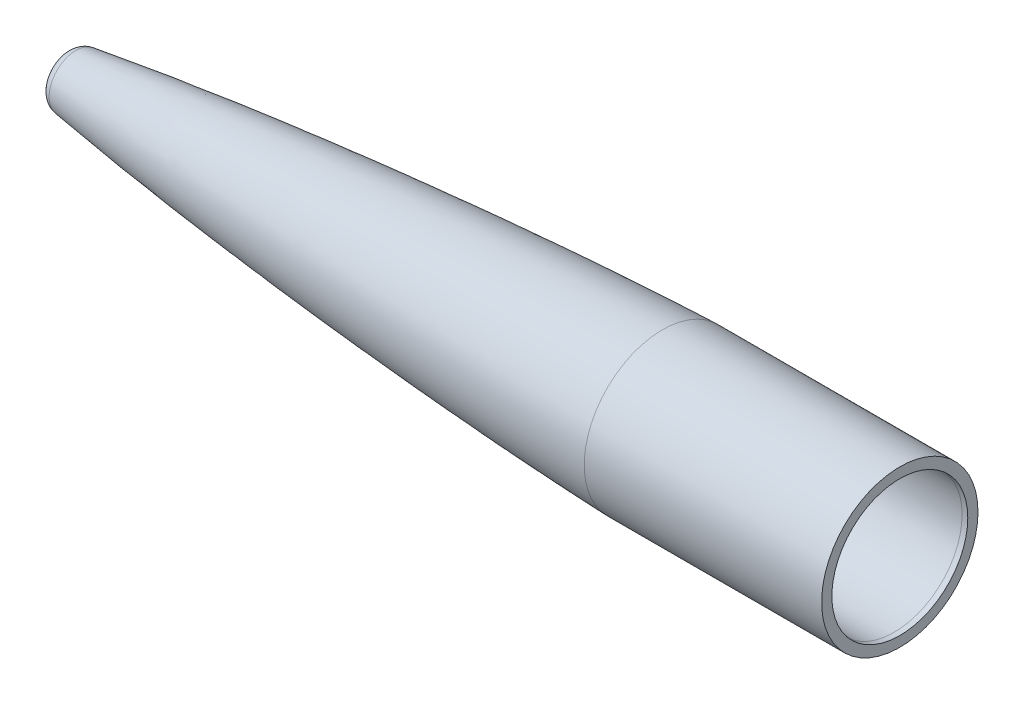
ISO-10303-21;
HEADER;
FILE_DESCRIPTION(('STEP AP214'),'2;1');
FILE_NAME('part.step','',(''),(''),'','','');
FILE_SCHEMA(('AUTOMOTIVE_DESIGN { 1 0 10303 214 1 1 1 1 }'));
ENDSEC;
DATA;
#1=APPLICATION_CONTEXT('core data for automotive mechanical design processes');
#2=APPLICATION_PROTOCOL_DEFINITION('international standard','automotive_design',2000,#1);
#3=PRODUCT_CONTEXT('',#1,'mechanical');
#4=PRODUCT('Part','Part','',(#3));
#5=PRODUCT_RELATED_PRODUCT_CATEGORY('part','',(#4));
#6=PRODUCT_DEFINITION_FORMATION('','',#4);
#7=PRODUCT_DEFINITION_CONTEXT('part definition',#1,'design');
#8=PRODUCT_DEFINITION('design','',#6,#7);
#9=PRODUCT_DEFINITION_SHAPE('','',#8);
#10=(LENGTH_UNIT() NAMED_UNIT(*) SI_UNIT(.MILLI.,.METRE.));
#11=(NAMED_UNIT(*) PLANE_ANGLE_UNIT() SI_UNIT($,.RADIAN.));
#12=(NAMED_UNIT(*) SI_UNIT($,.STERADIAN.) SOLID_ANGLE_UNIT());
#13=UNCERTAINTY_MEASURE_WITH_UNIT(LENGTH_MEASURE(1.E-05),#10,'distance_accuracy_value','');
#14=(GEOMETRIC_REPRESENTATION_CONTEXT(3) GLOBAL_UNCERTAINTY_ASSIGNED_CONTEXT((#13)) GLOBAL_UNIT_ASSIGNED_CONTEXT((#10,
#11,#12)) REPRESENTATION_CONTEXT('',''));
#15=CARTESIAN_POINT('',(0.,0.,0.));
#16=DIRECTION('',(0.,0.,1.));
#17=DIRECTION('',(1.,0.,0.));
#18=AXIS2_PLACEMENT_3D('',#15,#16,#17);
#19=CARTESIAN_POINT('',(0.,-76.2,0.));
#20=DIRECTION('',(1.,0.,0.));
#21=DIRECTION('',(0.,0.,-1.));
#22=AXIS2_PLACEMENT_3D('',#19,#20,#21);
#23=CYLINDRICAL_SURFACE('',#22,87.6605702842971);
#24=CARTESIAN_POINT('',(6.35000000000027,-76.2,0.));
#25=DIRECTION('',(1.,0.,0.));
#26=DIRECTION('',(0.,0.,-1.));
#27=AXIS2_PLACEMENT_3D('',#24,#25,#26);
#28=CIRCLE('',#27,87.6605702842971);
#29=CARTESIAN_POINT('',(6.35000000000027,-76.2,-87.6605702842971));
#30=VERTEX_POINT('',#29);
#31=EDGE_CURVE('E69',#30,#30,#28,.T.);
#32=ORIENTED_EDGE('',*,*,#31,.F.);
#33=EDGE_LOOP('',(#32));
#34=FACE_BOUND('',#33,.T.);
#35=CARTESIAN_POINT('',(-259.812483714893,-76.2,0.));
#36=DIRECTION('',(1.,0.,0.));
#37=DIRECTION('',(0.,0.,-1.));
#38=AXIS2_PLACEMENT_3D('',#35,#36,#37);
#39=CIRCLE('',#38,87.6605702842971);
#40=CARTESIAN_POINT('',(-259.812483714893,-76.2,-87.6605702842971));
#41=VERTEX_POINT('',#40);
#42=EDGE_CURVE('E10',#41,#41,#39,.T.);
#43=ORIENTED_EDGE('',*,*,#42,.T.);
#44=EDGE_LOOP('',(#43));
#45=FACE_BOUND('',#44,.T.);
#46=ADVANCED_FACE('F32',(#34,#45),#23,.T.);
#47=CARTESIAN_POINT('',(-259.812483714893,11.460570284297,0.));
#48=CARTESIAN_POINT('',(-287.312106379697,10.5623408515305,0.));
#49=CARTESIAN_POINT('',(-342.298022137353,8.17156900853598,0.));
#50=CARTESIAN_POINT('',(-452.140135715747,1.83352473554385,0.));
#51=CARTESIAN_POINT('',(-589.280273051557,-8.5121188078909,0.));
#52=CARTESIAN_POINT('',(-726.176632388446,-21.7709007537404,0.));
#53=CARTESIAN_POINT('',(-835.465785428388,-34.5887261399924,0.));
#54=CARTESIAN_POINT('',(-890.027026606975,-41.9652027624198,0.));
#55=CARTESIAN_POINT('',(-917.245364412614,-46.0396236215406,0.));
#56=B_SPLINE_CURVE_WITH_KNOTS('',3,(#47,#48,#49,#50,#51,#52,#53,#54,#55),.UNSPECIFIED.,.F.,.F.,
(4,1,1,1,1,1,4),(0.121539177885851,0.200323508121493,0.279107838357135,0.436676498828419,
0.594245159299703,0.673029489535345,0.751813819770986),.UNSPECIFIED.);
#57=CARTESIAN_POINT('',(0.,-76.2,0.));
#58=DIRECTION('',(1.,0.,0.));
#59=AXIS1_PLACEMENT('',#57,#58);
#60=SURFACE_OF_REVOLUTION('',#56,#59);
#61=CARTESIAN_POINT('',(-917.245364412614,-76.2,0.));
#62=DIRECTION('',(1.,0.,0.));
#63=DIRECTION('',(0.,0.,-1.));
#64=AXIS2_PLACEMENT_3D('',#61,#62,#63);
#65=CIRCLE('',#64,30.1603763784594);
#66=CARTESIAN_POINT('',(-917.245364412614,-76.2,-30.1603763784594));
#67=VERTEX_POINT('',#66);
#68=EDGE_CURVE('E38',#67,#67,#65,.T.);
#69=ORIENTED_EDGE('',*,*,#68,.T.);
#70=EDGE_LOOP('',(#69));
#71=FACE_BOUND('',#70,.T.);
#72=ORIENTED_EDGE('',*,*,#42,.F.);
#73=EDGE_LOOP('',(#72));
#74=FACE_BOUND('',#73,.T.);
#75=ADVANCED_FACE('F113',(#71,#74),#60,.F.);
#76=CARTESIAN_POINT('',(-915.3652,-76.2,0.));
#77=DIRECTION('',(1.,0.,0.));
#78=DIRECTION('',(0.,0.,-1.));
#79=AXIS2_PLACEMENT_3D('',#76,#77,#78);
#80=TOROIDAL_SURFACE('',#79,17.6003213713529,12.7);
#81=CARTESIAN_POINT('',(-928.0652,-76.2,0.));
#82=DIRECTION('',(1.,0.,0.));
#83=DIRECTION('',(0.,0.,-1.));
#84=AXIS2_PLACEMENT_3D('',#81,#82,#83);
#85=CIRCLE('',#84,17.6003213713529);
#86=CARTESIAN_POINT('',(-928.0652,-76.2,-17.6003213713529));
#87=VERTEX_POINT('',#86);
#88=EDGE_CURVE('E42',#87,#87,#85,.T.);
#89=ORIENTED_EDGE('',*,*,#88,.T.);
#90=EDGE_LOOP('',(#89));
#91=FACE_BOUND('',#90,.T.);
#92=ORIENTED_EDGE('',*,*,#68,.F.);
#93=EDGE_LOOP('',(#92));
#94=FACE_BOUND('',#93,.T.);
#95=ADVANCED_FACE('F110',(#91,#94),#80,.T.);
#96=CARTESIAN_POINT('',(0.,-76.2,0.));
#97=DIRECTION('',(1.,0.,0.));
#98=DIRECTION('',(0.,0.,-1.));
#99=AXIS2_PLACEMENT_3D('',#96,#97,#98);
#100=CYLINDRICAL_SURFACE('',#99,17.6003213713529);
#101=ORIENTED_EDGE('',*,*,#88,.F.);
#102=EDGE_LOOP('',(#101));
#103=FACE_BOUND('',#102,.T.);
#104=CARTESIAN_POINT('',(-921.7152,-76.2,0.));
#105=DIRECTION('',(1.,0.,0.));
#106=DIRECTION('',(0.,0.,-1.));
#107=AXIS2_PLACEMENT_3D('',#104,#105,#106);
#108=CIRCLE('',#107,17.6003213713529);
#109=CARTESIAN_POINT('',(-921.7152,-76.2,-17.6003213713529));
#110=VERTEX_POINT('',#109);
#111=EDGE_CURVE('E46',#110,#110,#108,.T.);
#112=ORIENTED_EDGE('',*,*,#111,.T.);
#113=EDGE_LOOP('',(#112));
#114=FACE_BOUND('',#113,.T.);
#115=ADVANCED_FACE('F106',(#103,#114),#100,.F.);
#116=CARTESIAN_POINT('',(-915.3652,-76.2,0.));
#117=DIRECTION('',(1.,0.,0.));
#118=DIRECTION('',(0.,0.,-1.));
#119=AXIS2_PLACEMENT_3D('',#116,#117,#118);
#120=TOROIDAL_SURFACE('',#119,17.6003213713529,6.35000000000007);
#121=ORIENTED_EDGE('',*,*,#111,.F.);
#122=EDGE_LOOP('',(#121));
#123=FACE_BOUND('',#122,.T.);
#124=CARTESIAN_POINT('',(-916.305282206307,-76.2,0.));
#125=DIRECTION('',(1.,0.,0.));
#126=DIRECTION('',(0.,0.,-1.));
#127=AXIS2_PLACEMENT_3D('',#124,#125,#126);
#128=CIRCLE('',#127,23.8803488749062);
#129=CARTESIAN_POINT('',(-916.305282206307,-76.2,-23.8803488749062));
#130=VERTEX_POINT('',#129);
#131=EDGE_CURVE('E51',#130,#130,#128,.T.);
#132=ORIENTED_EDGE('',*,*,#131,.T.);
#133=EDGE_LOOP('',(#132));
#134=FACE_BOUND('',#133,.T.);
#135=ADVANCED_FACE('F102',(#123,#134),#120,.F.);
#136=CARTESIAN_POINT('',(-259.605182082093,5.11395496327444,0.));
#137=CARTESIAN_POINT('',(-267.12768254606,4.86824499819252,0.));
#138=CARTESIAN_POINT('',(-283.426031509972,4.28566928092725,0.));
#139=CARTESIAN_POINT('',(-317.270262328934,2.88050564552106,0.));
#140=CARTESIAN_POINT('',(-361.130016616179,0.711244662128463,0.));
#141=CARTESIAN_POINT('',(-431.275457268552,-3.37195649395594,0.));
#142=CARTESIAN_POINT('',(-501.372917975129,-8.26687627302136,0.));
#143=CARTESIAN_POINT('',(-571.414486842692,-13.8916826479783,0.));
#144=CARTESIAN_POINT('',(-623.914744737059,-18.4776988889442,0.));
#145=CARTESIAN_POINT('',(-676.380314026956,-23.4393497952148,0.));
#146=CARTESIAN_POINT('',(-728.805663240347,-28.7990620723279,0.));
#147=CARTESIAN_POINT('',(-772.453634614019,-33.627485173269,0.));
#148=CARTESIAN_POINT('',(-807.341816529924,-37.7391545432386,0.));
#149=CARTESIAN_POINT('',(-833.490683910714,-40.9589001471484,0.));
#150=CARTESIAN_POINT('',(-859.619375691871,-44.3289411148186,0.));
#151=CARTESIAN_POINT('',(-885.723877264818,-47.8693351323976,0.));
#152=CARTESIAN_POINT('',(-904.61249297492,-50.577906922154,0.));
#153=CARTESIAN_POINT('',(-914.800968172167,-52.0944643953555,0.));
#154=CARTESIAN_POINT('',(-916.305282206307,-52.3196511250938,0.));
#155=B_SPLINE_CURVE_WITH_KNOTS('',3,(#136,#137,#138,#139,#140,#141,#142,#143,#144,#145,#146,
#147,#148,#149,#150,#151,#152,#153,#154),.UNSPECIFIED.,.F.,.F.,(4,1,1,1,1,1,1,1,1,1,1,1,1,1,1,1,
4),(0.121539177885851,0.143122913317239,0.168303261053087,0.218663956524784,0.26902465199648,
0.369746042939873,0.420106738411569,0.470467433883266,0.520828129354962,0.571188824826659,
0.621549520298355,0.646729868034203,0.671910215770052,0.6970905635059,0.722270911241748,
0.747451258977596,0.751813819770986),.UNSPECIFIED.);
#156=CARTESIAN_POINT('',(0.,-76.2,0.));
#157=DIRECTION('',(1.,0.,0.));
#158=AXIS1_PLACEMENT('',#156,#157);
#159=SURFACE_OF_REVOLUTION('',#155,#158);
#160=ORIENTED_EDGE('',*,*,#131,.F.);
#161=EDGE_LOOP('',(#160));
#162=FACE_BOUND('',#161,.T.);
#163=CARTESIAN_POINT('',(-259.605182082093,-76.2,0.));
#164=DIRECTION('',(1.,0.,0.));
#165=DIRECTION('',(0.,0.,-1.));
#166=AXIS2_PLACEMENT_3D('',#163,#164,#165);
#167=CIRCLE('',#166,81.3139549632744);
#168=CARTESIAN_POINT('',(-259.605182082093,-76.2,-81.3139549632744));
#169=VERTEX_POINT('',#168);
#170=EDGE_CURVE('E54',#169,#169,#167,.T.);
#171=ORIENTED_EDGE('',*,*,#170,.T.);
#172=EDGE_LOOP('',(#171));
#173=FACE_BOUND('',#172,.T.);
#174=ADVANCED_FACE('F98',(#162,#173),#159,.T.);
#175=CARTESIAN_POINT('',(-259.397880449279,-76.2,0.));
#176=DIRECTION('',(1.,0.,0.));
#177=DIRECTION('',(0.,0.,-1.));
#178=AXIS2_PLACEMENT_3D('',#175,#176,#177);
#179=TOROIDAL_SURFACE('',#178,74.9673396422523,6.35000000000002);
#180=ORIENTED_EDGE('',*,*,#170,.F.);
#181=EDGE_LOOP('',(#180));
#182=FACE_BOUND('',#181,.T.);
#183=CARTESIAN_POINT('',(-254.,-76.2,0.));
#184=DIRECTION('',(1.,0.,0.));
#185=DIRECTION('',(0.,0.,-1.));
#186=AXIS2_PLACEMENT_3D('',#183,#184,#185);
#187=CIRCLE('',#186,78.3117957497969);
#188=CARTESIAN_POINT('',(-254.,-76.2,-78.3117957497969));
#189=VERTEX_POINT('',#188);
#190=EDGE_CURVE('E57',#189,#189,#187,.T.);
#191=ORIENTED_EDGE('',*,*,#190,.T.);
#192=EDGE_LOOP('',(#191));
#193=FACE_BOUND('',#192,.T.);
#194=ADVANCED_FACE('F94',(#182,#193),#179,.F.);
#195=CARTESIAN_POINT('',(-248.602119550721,-76.2,0.));
#196=DIRECTION('',(1.,0.,0.));
#197=DIRECTION('',(0.,0.,-1.));
#198=AXIS2_PLACEMENT_3D('',#195,#196,#197);
#199=TOROIDAL_SURFACE('',#198,81.6562518573414,6.34999999999995);
#200=CARTESIAN_POINT('',(-248.413737761523,-76.2,0.));
#201=DIRECTION('',(1.,0.,0.));
#202=DIRECTION('',(0.,0.,-1.));
#203=AXIS2_PLACEMENT_3D('',#200,#201,#202);
#204=CIRCLE('',#203,75.3090467793958);
#205=CARTESIAN_POINT('',(-248.413737761523,-76.2,-75.3090467793958));
#206=VERTEX_POINT('',#205);
#207=EDGE_CURVE('E60',#206,#206,#204,.T.);
#208=ORIENTED_EDGE('',*,*,#207,.T.);
#209=EDGE_LOOP('',(#208));
#210=FACE_BOUND('',#209,.T.);
#211=ORIENTED_EDGE('',*,*,#190,.F.);
#212=EDGE_LOOP('',(#211));
#213=FACE_BOUND('',#212,.T.);
#214=ADVANCED_FACE('F89',(#210,#213),#199,.T.);
#215=CARTESIAN_POINT('',(0.,0.,0.));
#216=CARTESIAN_POINT('',(-50.8,0.,0.));
#217=CARTESIAN_POINT('',(-101.6,0.,0.));
#218=CARTESIAN_POINT('',(-157.18237532759,0.,0.));
#219=CARTESIAN_POINT('',(-166.74712598277,0.,0.));
#220=CARTESIAN_POINT('',(-181.09425196554,0.,0.));
#221=CARTESIAN_POINT('',(-190.65900262072,0.,0.));
#222=CARTESIAN_POINT('',(-199.585120864969,0.,0.));
#223=CARTESIAN_POINT('',(-207.872606698287,0.,0.));
#224=CARTESIAN_POINT('',(-220.304800851467,-0.15495983877073,0.));
#225=CARTESIAN_POINT('',(-228.589711976257,-0.361524820706449,0.));
#226=CARTESIAN_POINT('',(-235.094659098791,-0.523710541786571,0.));
#227=CARTESIAN_POINT('',(-239.819642219067,-0.641517002011094,0.));
#228=CARTESIAN_POINT('',(-245.046645358789,-0.791480258471811,0.));
#229=CARTESIAN_POINT('',(-247.911294959409,-0.876040976098197,0.));
#230=CARTESIAN_POINT('',(-248.413737761523,-0.890953220604229,0.));
#231=B_SPLINE_CURVE_WITH_KNOTS('',3,(#215,#216,#217,#218,#219,#220,#221,#222,#223,#224,#225,
#226,#227,#228,#229,#230),.UNSPECIFIED.,.F.,.F.,(4,2,1,1,2,1,1,2,1,1,4),(0.761574076780111,
0.907841521459126,0.921611321039098,0.93538112061907,0.949150920199042,0.961081917990901,
0.97301291578276,0.98494391357462,0.991748303184292,0.998552692793965,1.),.UNSPECIFIED.);
#232=CARTESIAN_POINT('',(0.,-76.2,0.));
#233=DIRECTION('',(1.,0.,0.));
#234=AXIS1_PLACEMENT('',#232,#233);
#235=SURFACE_OF_REVOLUTION('',#231,#234);
#236=ORIENTED_EDGE('',*,*,#207,.F.);
#237=EDGE_LOOP('',(#236));
#238=FACE_BOUND('',#237,.T.);
#239=CARTESIAN_POINT('',(0.,-76.2,0.));
#240=DIRECTION('',(1.,0.,0.));
#241=DIRECTION('',(0.,0.,-1.));
#242=AXIS2_PLACEMENT_3D('',#239,#240,#241);
#243=CIRCLE('',#242,76.2);
#244=CARTESIAN_POINT('',(0.,-76.2,-76.2));
#245=VERTEX_POINT('',#244);
#246=EDGE_CURVE('E63',#245,#245,#243,.T.);
#247=ORIENTED_EDGE('',*,*,#246,.T.);
#248=EDGE_LOOP('',(#247));
#249=FACE_BOUND('',#248,.T.);
#250=ADVANCED_FACE('F84',(#238,#249),#235,.T.);
#251=CARTESIAN_POINT('',(0.,-76.2,0.));
#252=DIRECTION('',(1.,0.,0.));
#253=DIRECTION('',(0.,0.,-1.));
#254=AXIS2_PLACEMENT_3D('',#251,#252,#253);
#255=CYLINDRICAL_SURFACE('',#254,76.2);
#256=CARTESIAN_POINT('',(6.34999999999949,-76.2,0.));
#257=DIRECTION('',(1.,0.,0.));
#258=DIRECTION('',(0.,0.,-1.));
#259=AXIS2_PLACEMENT_3D('',#256,#257,#258);
#260=CIRCLE('',#259,76.2);
#261=CARTESIAN_POINT('',(6.34999999999949,-76.2,-76.2));
#262=VERTEX_POINT('',#261);
#263=EDGE_CURVE('E66',#262,#262,#260,.T.);
#264=ORIENTED_EDGE('',*,*,#263,.T.);
#265=EDGE_LOOP('',(#264));
#266=FACE_BOUND('',#265,.T.);
#267=ORIENTED_EDGE('',*,*,#246,.F.);
#268=EDGE_LOOP('',(#267));
#269=FACE_BOUND('',#268,.T.);
#270=ADVANCED_FACE('F88',(#266,#269),#255,.F.);
#271=CARTESIAN_POINT('',(6.34999999999988,-7.78023478975536E-13,0.));
#272=DIRECTION('',(-1.,0.,0.));
#273=DIRECTION('',(0.,0.,1.));
#274=AXIS2_PLACEMENT_3D('',#271,#272,#273);
#275=PLANE('',#274);
#276=ORIENTED_EDGE('',*,*,#263,.F.);
#277=EDGE_LOOP('',(#276));
#278=FACE_BOUND('',#277,.T.);
#279=ORIENTED_EDGE('',*,*,#31,.T.);
#280=EDGE_LOOP('',(#279));
#281=FACE_BOUND('',#280,.T.);
#282=ADVANCED_FACE('F131',(#278,#281),#275,.F.);
#283=CLOSED_SHELL('',(#46,#75,#95,#115,#135,#174,#194,#214,#250,#270,#282));
#284=MANIFOLD_SOLID_BREP('B2',#283);
#285=ADVANCED_BREP_SHAPE_REPRESENTATION('',(#18,#284),#14);
#286=SHAPE_DEFINITION_REPRESENTATION(#9,#285);
ENDSEC;
END-ISO-10303-21;
